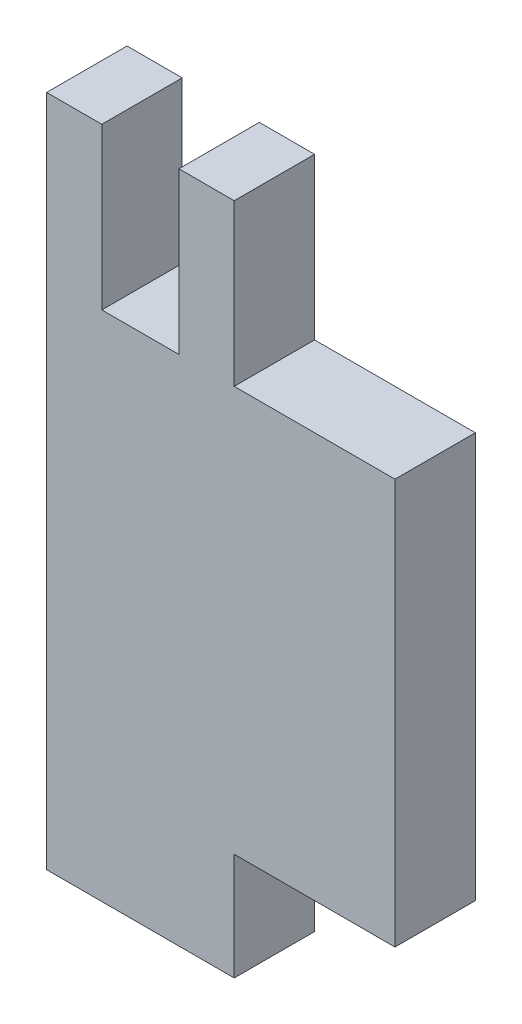
ISO-10303-21;
HEADER;
FILE_DESCRIPTION(('STEP AP214'),'2;1');
FILE_NAME('part.step','',(''),(''),'','','');
FILE_SCHEMA(('AUTOMOTIVE_DESIGN { 1 0 10303 214 1 1 1 1 }'));
ENDSEC;
DATA;
#1=APPLICATION_CONTEXT('core data for automotive mechanical design processes');
#2=APPLICATION_PROTOCOL_DEFINITION('international standard','automotive_design',2000,#1);
#3=PRODUCT_CONTEXT('',#1,'mechanical');
#4=PRODUCT('Part','Part','',(#3));
#5=PRODUCT_RELATED_PRODUCT_CATEGORY('part','',(#4));
#6=PRODUCT_DEFINITION_FORMATION('','',#4);
#7=PRODUCT_DEFINITION_CONTEXT('part definition',#1,'design');
#8=PRODUCT_DEFINITION('design','',#6,#7);
#9=PRODUCT_DEFINITION_SHAPE('','',#8);
#10=(LENGTH_UNIT() NAMED_UNIT(*) SI_UNIT(.MILLI.,.METRE.));
#11=(NAMED_UNIT(*) PLANE_ANGLE_UNIT() SI_UNIT($,.RADIAN.));
#12=(NAMED_UNIT(*) SI_UNIT($,.STERADIAN.) SOLID_ANGLE_UNIT());
#13=UNCERTAINTY_MEASURE_WITH_UNIT(LENGTH_MEASURE(1.E-05),#10,'distance_accuracy_value','');
#14=(GEOMETRIC_REPRESENTATION_CONTEXT(3) GLOBAL_UNCERTAINTY_ASSIGNED_CONTEXT((#13)) GLOBAL_UNIT_ASSIGNED_CONTEXT((#10,
#11,#12)) REPRESENTATION_CONTEXT('',''));
#15=CARTESIAN_POINT('',(0.,0.,0.));
#16=DIRECTION('',(0.,0.,1.));
#17=DIRECTION('',(1.,0.,0.));
#18=AXIS2_PLACEMENT_3D('',#15,#16,#17);
#19=CARTESIAN_POINT('',(0.,25.123,3.));
#20=DIRECTION('',(0.,1.,0.));
#21=DIRECTION('',(0.,0.,1.));
#22=AXIS2_PLACEMENT_3D('',#19,#20,#21);
#23=PLANE('',#22);
#24=DIRECTION('',(1.,0.,0.));
#25=VECTOR('',#24,1.);
#26=CARTESIAN_POINT('',(0.,25.123,0.));
#27=LINE('',#26,#25);
#28=CARTESIAN_POINT('',(4.937,25.123,0.));
#29=VERTEX_POINT('',#28);
#30=CARTESIAN_POINT('',(7.,25.123,0.));
#31=VERTEX_POINT('',#30);
#32=EDGE_CURVE('E246',#29,#31,#27,.T.);
#33=ORIENTED_EDGE('',*,*,#32,.F.);
#34=DIRECTION('',(0.,0.,-1.));
#35=VECTOR('',#34,1.);
#36=CARTESIAN_POINT('',(4.937,25.123,3.));
#37=LINE('',#36,#35);
#38=CARTESIAN_POINT('',(4.937,25.123,3.));
#39=VERTEX_POINT('',#38);
#40=EDGE_CURVE('E12',#39,#29,#37,.T.);
#41=ORIENTED_EDGE('',*,*,#40,.F.);
#42=DIRECTION('',(1.,0.,0.));
#43=VECTOR('',#42,1.);
#44=CARTESIAN_POINT('',(0.,25.123,3.));
#45=LINE('',#44,#43);
#46=CARTESIAN_POINT('',(7.,25.123,3.));
#47=VERTEX_POINT('',#46);
#48=EDGE_CURVE('E207',#39,#47,#45,.T.);
#49=ORIENTED_EDGE('',*,*,#48,.T.);
#50=DIRECTION('',(0.,0.,-1.));
#51=VECTOR('',#50,1.);
#52=CARTESIAN_POINT('',(7.,25.123,3.));
#53=LINE('',#52,#51);
#54=EDGE_CURVE('E57',#47,#31,#53,.T.);
#55=ORIENTED_EDGE('',*,*,#54,.T.);
#56=EDGE_LOOP('',(#33,#41,#49,#55));
#57=FACE_BOUND('',#56,.T.);
#58=ADVANCED_FACE('F41',(#57),#23,.T.);
#59=CARTESIAN_POINT('',(4.937,0.,3.));
#60=DIRECTION('',(1.,0.,0.));
#61=DIRECTION('',(0.,1.,0.));
#62=AXIS2_PLACEMENT_3D('',#59,#60,#61);
#63=PLANE('',#62);
#64=DIRECTION('',(0.,-1.,0.));
#65=VECTOR('',#64,1.);
#66=CARTESIAN_POINT('',(4.937,0.,0.));
#67=LINE('',#66,#65);
#68=CARTESIAN_POINT('',(4.937,19.123,0.));
#69=VERTEX_POINT('',#68);
#70=EDGE_CURVE('E244',#29,#69,#67,.T.);
#71=ORIENTED_EDGE('',*,*,#70,.T.);
#72=DIRECTION('',(0.,0.,-1.));
#73=VECTOR('',#72,1.);
#74=CARTESIAN_POINT('',(4.937,19.123,3.));
#75=LINE('',#74,#73);
#76=CARTESIAN_POINT('',(4.937,19.123,3.));
#77=VERTEX_POINT('',#76);
#78=EDGE_CURVE('E49',#77,#69,#75,.T.);
#79=ORIENTED_EDGE('',*,*,#78,.F.);
#80=DIRECTION('',(0.,-1.,0.));
#81=VECTOR('',#80,1.);
#82=CARTESIAN_POINT('',(4.937,0.,3.));
#83=LINE('',#82,#81);
#84=EDGE_CURVE('E202',#39,#77,#83,.T.);
#85=ORIENTED_EDGE('',*,*,#84,.F.);
#86=ORIENTED_EDGE('',*,*,#40,.T.);
#87=EDGE_LOOP('',(#71,#79,#85,#86));
#88=FACE_BOUND('',#87,.T.);
#89=ADVANCED_FACE('F245',(#88),#63,.F.);
#90=CARTESIAN_POINT('',(0.,19.123,3.));
#91=DIRECTION('',(0.,1.,0.));
#92=DIRECTION('',(0.,0.,1.));
#93=AXIS2_PLACEMENT_3D('',#90,#91,#92);
#94=PLANE('',#93);
#95=DIRECTION('',(1.,0.,0.));
#96=VECTOR('',#95,1.);
#97=CARTESIAN_POINT('',(0.,19.123,0.));
#98=LINE('',#97,#96);
#99=CARTESIAN_POINT('',(2.06,19.123,0.));
#100=VERTEX_POINT('',#99);
#101=EDGE_CURVE('E239',#100,#69,#98,.T.);
#102=ORIENTED_EDGE('',*,*,#101,.F.);
#103=DIRECTION('',(0.,0.,-1.));
#104=VECTOR('',#103,1.);
#105=CARTESIAN_POINT('',(2.06,19.123,3.));
#106=LINE('',#105,#104);
#107=CARTESIAN_POINT('',(2.06,19.123,3.));
#108=VERTEX_POINT('',#107);
#109=EDGE_CURVE('E232',#108,#100,#106,.T.);
#110=ORIENTED_EDGE('',*,*,#109,.F.);
#111=DIRECTION('',(1.,0.,0.));
#112=VECTOR('',#111,1.);
#113=CARTESIAN_POINT('',(0.,19.123,3.));
#114=LINE('',#113,#112);
#115=EDGE_CURVE('E197',#108,#77,#114,.T.);
#116=ORIENTED_EDGE('',*,*,#115,.T.);
#117=ORIENTED_EDGE('',*,*,#78,.T.);
#118=EDGE_LOOP('',(#102,#110,#116,#117));
#119=FACE_BOUND('',#118,.T.);
#120=ADVANCED_FACE('F237',(#119),#94,.T.);
#121=CARTESIAN_POINT('',(2.06,0.,3.));
#122=DIRECTION('',(1.,0.,0.));
#123=DIRECTION('',(0.,1.,0.));
#124=AXIS2_PLACEMENT_3D('',#121,#122,#123);
#125=PLANE('',#124);
#126=DIRECTION('',(0.,-1.,0.));
#127=VECTOR('',#126,1.);
#128=CARTESIAN_POINT('',(2.06,0.,0.));
#129=LINE('',#128,#127);
#130=CARTESIAN_POINT('',(2.06,25.123,0.));
#131=VERTEX_POINT('',#130);
#132=EDGE_CURVE('E251',#131,#100,#129,.T.);
#133=ORIENTED_EDGE('',*,*,#132,.F.);
#134=DIRECTION('',(0.,0.,-1.));
#135=VECTOR('',#134,1.);
#136=CARTESIAN_POINT('',(2.06,25.123,3.));
#137=LINE('',#136,#135);
#138=CARTESIAN_POINT('',(2.06,25.123,3.));
#139=VERTEX_POINT('',#138);
#140=EDGE_CURVE('E230',#139,#131,#137,.T.);
#141=ORIENTED_EDGE('',*,*,#140,.F.);
#142=DIRECTION('',(0.,-1.,0.));
#143=VECTOR('',#142,1.);
#144=CARTESIAN_POINT('',(2.06,0.,3.));
#145=LINE('',#144,#143);
#146=EDGE_CURVE('E192',#139,#108,#145,.T.);
#147=ORIENTED_EDGE('',*,*,#146,.T.);
#148=ORIENTED_EDGE('',*,*,#109,.T.);
#149=EDGE_LOOP('',(#133,#141,#147,#148));
#150=FACE_BOUND('',#149,.T.);
#151=ADVANCED_FACE('F290',(#150),#125,.T.);
#152=CARTESIAN_POINT('',(0.,25.123,3.));
#153=DIRECTION('',(0.,-1.,0.));
#154=DIRECTION('',(0.,0.,-1.));
#155=AXIS2_PLACEMENT_3D('',#152,#153,#154);
#156=PLANE('',#155);
#157=DIRECTION('',(-1.,0.,0.));
#158=VECTOR('',#157,1.);
#159=CARTESIAN_POINT('',(0.,25.123,0.));
#160=LINE('',#159,#158);
#161=CARTESIAN_POINT('',(0.,25.123,0.));
#162=VERTEX_POINT('',#161);
#163=EDGE_CURVE('E253',#131,#162,#160,.T.);
#164=ORIENTED_EDGE('',*,*,#163,.T.);
#165=DIRECTION('',(0.,0.,-1.));
#166=VECTOR('',#165,1.);
#167=CARTESIAN_POINT('',(0.,25.123,3.));
#168=LINE('',#167,#166);
#169=CARTESIAN_POINT('',(0.,25.123,3.));
#170=VERTEX_POINT('',#169);
#171=EDGE_CURVE('E228',#170,#162,#168,.T.);
#172=ORIENTED_EDGE('',*,*,#171,.F.);
#173=DIRECTION('',(-1.,0.,0.));
#174=VECTOR('',#173,1.);
#175=CARTESIAN_POINT('',(0.,25.123,3.));
#176=LINE('',#175,#174);
#177=EDGE_CURVE('E189',#139,#170,#176,.T.);
#178=ORIENTED_EDGE('',*,*,#177,.F.);
#179=ORIENTED_EDGE('',*,*,#140,.T.);
#180=EDGE_LOOP('',(#164,#172,#178,#179));
#181=FACE_BOUND('',#180,.T.);
#182=ADVANCED_FACE('F287',(#181),#156,.F.);
#183=CARTESIAN_POINT('',(0.,0.,3.));
#184=DIRECTION('',(-1.,0.,0.));
#185=DIRECTION('',(0.,0.,1.));
#186=AXIS2_PLACEMENT_3D('',#183,#184,#185);
#187=PLANE('',#186);
#188=DIRECTION('',(0.,1.,0.));
#189=VECTOR('',#188,1.);
#190=CARTESIAN_POINT('',(0.,0.,0.));
#191=LINE('',#190,#189);
#192=CARTESIAN_POINT('',(0.,0.,0.));
#193=VERTEX_POINT('',#192);
#194=EDGE_CURVE('E258',#193,#162,#191,.T.);
#195=ORIENTED_EDGE('',*,*,#194,.F.);
#196=DIRECTION('',(0.,0.,-1.));
#197=VECTOR('',#196,1.);
#198=CARTESIAN_POINT('',(0.,0.,3.));
#199=LINE('',#198,#197);
#200=CARTESIAN_POINT('',(0.,0.,3.));
#201=VERTEX_POINT('',#200);
#202=EDGE_CURVE('E226',#201,#193,#199,.T.);
#203=ORIENTED_EDGE('',*,*,#202,.F.);
#204=DIRECTION('',(0.,1.,0.));
#205=VECTOR('',#204,1.);
#206=CARTESIAN_POINT('',(0.,0.,3.));
#207=LINE('',#206,#205);
#208=EDGE_CURVE('E181',#201,#170,#207,.T.);
#209=ORIENTED_EDGE('',*,*,#208,.T.);
#210=ORIENTED_EDGE('',*,*,#171,.T.);
#211=EDGE_LOOP('',(#195,#203,#209,#210));
#212=FACE_BOUND('',#211,.T.);
#213=ADVANCED_FACE('F281',(#212),#187,.T.);
#214=CARTESIAN_POINT('',(0.,0.,3.));
#215=DIRECTION('',(0.,-1.,0.));
#216=DIRECTION('',(1.,0.,0.));
#217=AXIS2_PLACEMENT_3D('',#214,#215,#216);
#218=PLANE('',#217);
#219=DIRECTION('',(-1.,0.,0.));
#220=VECTOR('',#219,1.);
#221=CARTESIAN_POINT('',(0.,0.,0.));
#222=LINE('',#221,#220);
#223=CARTESIAN_POINT('',(7.,0.,0.));
#224=VERTEX_POINT('',#223);
#225=EDGE_CURVE('E261',#224,#193,#222,.T.);
#226=ORIENTED_EDGE('',*,*,#225,.F.);
#227=DIRECTION('',(0.,0.,-1.));
#228=VECTOR('',#227,1.);
#229=CARTESIAN_POINT('',(7.,0.,3.));
#230=LINE('',#229,#228);
#231=CARTESIAN_POINT('',(7.,0.,3.));
#232=VERTEX_POINT('',#231);
#233=EDGE_CURVE('E224',#232,#224,#230,.T.);
#234=ORIENTED_EDGE('',*,*,#233,.F.);
#235=DIRECTION('',(-1.,0.,0.));
#236=VECTOR('',#235,1.);
#237=CARTESIAN_POINT('',(0.,0.,3.));
#238=LINE('',#237,#236);
#239=EDGE_CURVE('E176',#232,#201,#238,.T.);
#240=ORIENTED_EDGE('',*,*,#239,.T.);
#241=ORIENTED_EDGE('',*,*,#202,.T.);
#242=EDGE_LOOP('',(#226,#234,#240,#241));
#243=FACE_BOUND('',#242,.T.);
#244=ADVANCED_FACE('F278',(#243),#218,.T.);
#245=CARTESIAN_POINT('',(7.,0.,3.));
#246=DIRECTION('',(1.,0.,0.));
#247=DIRECTION('',(0.,1.,0.));
#248=AXIS2_PLACEMENT_3D('',#245,#246,#247);
#249=PLANE('',#248);
#250=DIRECTION('',(0.,-1.,0.));
#251=VECTOR('',#250,1.);
#252=CARTESIAN_POINT('',(7.,0.,0.));
#253=LINE('',#252,#251);
#254=CARTESIAN_POINT('',(7.,4.,0.));
#255=VERTEX_POINT('',#254);
#256=EDGE_CURVE('E264',#255,#224,#253,.T.);
#257=ORIENTED_EDGE('',*,*,#256,.F.);
#258=DIRECTION('',(0.,0.,-1.));
#259=VECTOR('',#258,1.);
#260=CARTESIAN_POINT('',(7.,4.,3.));
#261=LINE('',#260,#259);
#262=CARTESIAN_POINT('',(7.,4.,3.));
#263=VERTEX_POINT('',#262);
#264=EDGE_CURVE('E222',#263,#255,#261,.T.);
#265=ORIENTED_EDGE('',*,*,#264,.F.);
#266=DIRECTION('',(0.,-1.,0.));
#267=VECTOR('',#266,1.);
#268=CARTESIAN_POINT('',(7.,0.,3.));
#269=LINE('',#268,#267);
#270=EDGE_CURVE('E171',#263,#232,#269,.T.);
#271=ORIENTED_EDGE('',*,*,#270,.T.);
#272=ORIENTED_EDGE('',*,*,#233,.T.);
#273=EDGE_LOOP('',(#257,#265,#271,#272));
#274=FACE_BOUND('',#273,.T.);
#275=ADVANCED_FACE('F274',(#274),#249,.T.);
#276=CARTESIAN_POINT('',(0.,4.,3.));
#277=DIRECTION('',(0.,-1.,0.));
#278=DIRECTION('',(1.,0.,0.));
#279=AXIS2_PLACEMENT_3D('',#276,#277,#278);
#280=PLANE('',#279);
#281=DIRECTION('',(-1.,0.,0.));
#282=VECTOR('',#281,1.);
#283=CARTESIAN_POINT('',(0.,4.,0.));
#284=LINE('',#283,#282);
#285=CARTESIAN_POINT('',(13.,4.,0.));
#286=VERTEX_POINT('',#285);
#287=EDGE_CURVE('E267',#286,#255,#284,.T.);
#288=ORIENTED_EDGE('',*,*,#287,.F.);
#289=DIRECTION('',(0.,0.,-1.));
#290=VECTOR('',#289,1.);
#291=CARTESIAN_POINT('',(13.,4.,3.));
#292=LINE('',#291,#290);
#293=CARTESIAN_POINT('',(13.,4.,3.));
#294=VERTEX_POINT('',#293);
#295=EDGE_CURVE('E140',#294,#286,#292,.T.);
#296=ORIENTED_EDGE('',*,*,#295,.F.);
#297=DIRECTION('',(-1.,0.,0.));
#298=VECTOR('',#297,1.);
#299=CARTESIAN_POINT('',(0.,4.,3.));
#300=LINE('',#299,#298);
#301=EDGE_CURVE('E151',#294,#263,#300,.T.);
#302=ORIENTED_EDGE('',*,*,#301,.T.);
#303=ORIENTED_EDGE('',*,*,#264,.T.);
#304=EDGE_LOOP('',(#288,#296,#302,#303));
#305=FACE_BOUND('',#304,.T.);
#306=ADVANCED_FACE('F272',(#305),#280,.T.);
#307=CARTESIAN_POINT('',(13.,0.,3.));
#308=DIRECTION('',(1.,0.,0.));
#309=DIRECTION('',(0.,1.,0.));
#310=AXIS2_PLACEMENT_3D('',#307,#308,#309);
#311=PLANE('',#310);
#312=DIRECTION('',(0.,-1.,0.));
#313=VECTOR('',#312,1.);
#314=CARTESIAN_POINT('',(13.,0.,0.));
#315=LINE('',#314,#313);
#316=CARTESIAN_POINT('',(13.,19.123,0.));
#317=VERTEX_POINT('',#316);
#318=EDGE_CURVE('E136',#317,#286,#315,.T.);
#319=ORIENTED_EDGE('',*,*,#318,.F.);
#320=DIRECTION('',(0.,0.,-1.));
#321=VECTOR('',#320,1.);
#322=CARTESIAN_POINT('',(13.,19.123,3.));
#323=LINE('',#322,#321);
#324=CARTESIAN_POINT('',(13.,19.123,3.));
#325=VERTEX_POINT('',#324);
#326=EDGE_CURVE('E131',#325,#317,#323,.T.);
#327=ORIENTED_EDGE('',*,*,#326,.F.);
#328=DIRECTION('',(0.,-1.,0.));
#329=VECTOR('',#328,1.);
#330=CARTESIAN_POINT('',(13.,0.,3.));
#331=LINE('',#330,#329);
#332=EDGE_CURVE('E134',#325,#294,#331,.T.);
#333=ORIENTED_EDGE('',*,*,#332,.T.);
#334=ORIENTED_EDGE('',*,*,#295,.T.);
#335=EDGE_LOOP('',(#319,#327,#333,#334));
#336=FACE_BOUND('',#335,.T.);
#337=ADVANCED_FACE('F133',(#336),#311,.T.);
#338=CARTESIAN_POINT('',(0.,19.123,3.));
#339=DIRECTION('',(0.,1.,0.));
#340=DIRECTION('',(0.,0.,1.));
#341=AXIS2_PLACEMENT_3D('',#338,#339,#340);
#342=PLANE('',#341);
#343=DIRECTION('',(1.,0.,0.));
#344=VECTOR('',#343,1.);
#345=CARTESIAN_POINT('',(0.,19.123,0.));
#346=LINE('',#345,#344);
#347=CARTESIAN_POINT('',(7.,19.123,0.));
#348=VERTEX_POINT('',#347);
#349=EDGE_CURVE('E213',#348,#317,#346,.T.);
#350=ORIENTED_EDGE('',*,*,#349,.F.);
#351=DIRECTION('',(0.,0.,-1.));
#352=VECTOR('',#351,1.);
#353=CARTESIAN_POINT('',(7.,19.123,3.));
#354=LINE('',#353,#352);
#355=CARTESIAN_POINT('',(7.,19.123,3.));
#356=VERTEX_POINT('',#355);
#357=EDGE_CURVE('E94',#356,#348,#354,.T.);
#358=ORIENTED_EDGE('',*,*,#357,.F.);
#359=DIRECTION('',(1.,0.,0.));
#360=VECTOR('',#359,1.);
#361=CARTESIAN_POINT('',(0.,19.123,3.));
#362=LINE('',#361,#360);
#363=EDGE_CURVE('E148',#356,#325,#362,.T.);
#364=ORIENTED_EDGE('',*,*,#363,.T.);
#365=ORIENTED_EDGE('',*,*,#326,.T.);
#366=EDGE_LOOP('',(#350,#358,#364,#365));
#367=FACE_BOUND('',#366,.T.);
#368=ADVANCED_FACE('F154',(#367),#342,.T.);
#369=CARTESIAN_POINT('',(7.,0.,3.));
#370=DIRECTION('',(1.,0.,0.));
#371=DIRECTION('',(0.,0.,-1.));
#372=AXIS2_PLACEMENT_3D('',#369,#370,#371);
#373=PLANE('',#372);
#374=DIRECTION('',(0.,-1.,0.));
#375=VECTOR('',#374,1.);
#376=CARTESIAN_POINT('',(7.,0.,0.));
#377=LINE('',#376,#375);
#378=EDGE_CURVE('E210',#31,#348,#377,.T.);
#379=ORIENTED_EDGE('',*,*,#378,.F.);
#380=ORIENTED_EDGE('',*,*,#54,.F.);
#381=DIRECTION('',(0.,-1.,0.));
#382=VECTOR('',#381,1.);
#383=CARTESIAN_POINT('',(7.,0.,3.));
#384=LINE('',#383,#382);
#385=EDGE_CURVE('E156',#47,#356,#384,.T.);
#386=ORIENTED_EDGE('',*,*,#385,.T.);
#387=ORIENTED_EDGE('',*,*,#357,.T.);
#388=EDGE_LOOP('',(#379,#380,#386,#387));
#389=FACE_BOUND('',#388,.T.);
#390=ADVANCED_FACE('F291',(#389),#373,.T.);
#391=CARTESIAN_POINT('',(0.,0.,3.));
#392=DIRECTION('',(0.,0.,1.));
#393=DIRECTION('',(1.,0.,0.));
#394=AXIS2_PLACEMENT_3D('',#391,#392,#393);
#395=PLANE('',#394);
#396=ORIENTED_EDGE('',*,*,#48,.F.);
#397=ORIENTED_EDGE('',*,*,#84,.T.);
#398=ORIENTED_EDGE('',*,*,#115,.F.);
#399=ORIENTED_EDGE('',*,*,#146,.F.);
#400=ORIENTED_EDGE('',*,*,#177,.T.);
#401=ORIENTED_EDGE('',*,*,#208,.F.);
#402=ORIENTED_EDGE('',*,*,#239,.F.);
#403=ORIENTED_EDGE('',*,*,#270,.F.);
#404=ORIENTED_EDGE('',*,*,#301,.F.);
#405=ORIENTED_EDGE('',*,*,#332,.F.);
#406=ORIENTED_EDGE('',*,*,#363,.F.);
#407=ORIENTED_EDGE('',*,*,#385,.F.);
#408=EDGE_LOOP('',(#396,#397,#398,#399,#400,#401,#402,#403,#404,#405,#406,#407));
#409=FACE_BOUND('',#408,.T.);
#410=ADVANCED_FACE('F146',(#409),#395,.T.);
#411=CARTESIAN_POINT('',(0.,0.,0.));
#412=DIRECTION('',(0.,0.,1.));
#413=DIRECTION('',(1.,0.,0.));
#414=AXIS2_PLACEMENT_3D('',#411,#412,#413);
#415=PLANE('',#414);
#416=ORIENTED_EDGE('',*,*,#32,.T.);
#417=ORIENTED_EDGE('',*,*,#378,.T.);
#418=ORIENTED_EDGE('',*,*,#349,.T.);
#419=ORIENTED_EDGE('',*,*,#318,.T.);
#420=ORIENTED_EDGE('',*,*,#287,.T.);
#421=ORIENTED_EDGE('',*,*,#256,.T.);
#422=ORIENTED_EDGE('',*,*,#225,.T.);
#423=ORIENTED_EDGE('',*,*,#194,.T.);
#424=ORIENTED_EDGE('',*,*,#163,.F.);
#425=ORIENTED_EDGE('',*,*,#132,.T.);
#426=ORIENTED_EDGE('',*,*,#101,.T.);
#427=ORIENTED_EDGE('',*,*,#70,.F.);
#428=EDGE_LOOP('',(#416,#417,#418,#419,#420,#421,#422,#423,#424,#425,#426,#427));
#429=FACE_BOUND('',#428,.T.);
#430=ADVANCED_FACE('F248',(#429),#415,.F.);
#431=CLOSED_SHELL('',(#58,#89,#120,#151,#182,#213,#244,#275,#306,#337,#368,#390,#410,#430));
#432=MANIFOLD_SOLID_BREP('B2',#431);
#433=ADVANCED_BREP_SHAPE_REPRESENTATION('',(#18,#432),#14);
#434=SHAPE_DEFINITION_REPRESENTATION(#9,#433);
ENDSEC;
END-ISO-10303-21;
